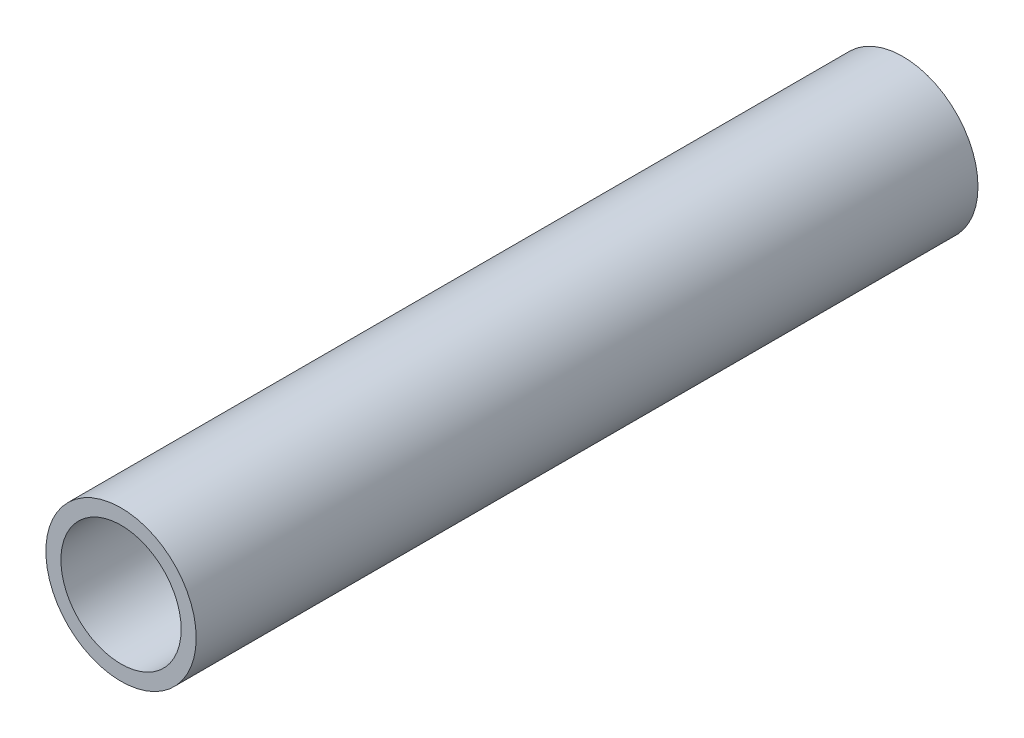
ISO-10303-21;
HEADER;
FILE_DESCRIPTION(('STEP AP214'),'2;1');
FILE_NAME('part.step','',(''),(''),'','','');
FILE_SCHEMA(('AUTOMOTIVE_DESIGN { 1 0 10303 214 1 1 1 1 }'));
ENDSEC;
DATA;
#1=APPLICATION_CONTEXT('core data for automotive mechanical design processes');
#2=APPLICATION_PROTOCOL_DEFINITION('international standard','automotive_design',2000,#1);
#3=PRODUCT_CONTEXT('',#1,'mechanical');
#4=PRODUCT('Part','Part','',(#3));
#5=PRODUCT_RELATED_PRODUCT_CATEGORY('part','',(#4));
#6=PRODUCT_DEFINITION_FORMATION('','',#4);
#7=PRODUCT_DEFINITION_CONTEXT('part definition',#1,'design');
#8=PRODUCT_DEFINITION('design','',#6,#7);
#9=PRODUCT_DEFINITION_SHAPE('','',#8);
#10=(LENGTH_UNIT() NAMED_UNIT(*) SI_UNIT(.MILLI.,.METRE.));
#11=(NAMED_UNIT(*) PLANE_ANGLE_UNIT() SI_UNIT($,.RADIAN.));
#12=(NAMED_UNIT(*) SI_UNIT($,.STERADIAN.) SOLID_ANGLE_UNIT());
#13=UNCERTAINTY_MEASURE_WITH_UNIT(LENGTH_MEASURE(1.E-05),#10,'distance_accuracy_value','');
#14=(GEOMETRIC_REPRESENTATION_CONTEXT(3) GLOBAL_UNCERTAINTY_ASSIGNED_CONTEXT((#13)) GLOBAL_UNIT_ASSIGNED_CONTEXT((#10,
#11,#12)) REPRESENTATION_CONTEXT('',''));
#15=CARTESIAN_POINT('',(0.,0.,0.));
#16=DIRECTION('',(0.,0.,1.));
#17=DIRECTION('',(1.,0.,0.));
#18=AXIS2_PLACEMENT_3D('',#15,#16,#17);
#19=CARTESIAN_POINT('',(0.,0.,130.));
#20=DIRECTION('',(0.,0.,1.));
#21=DIRECTION('',(1.,0.,0.));
#22=AXIS2_PLACEMENT_3D('',#19,#20,#21);
#23=PLANE('',#22);
#24=CARTESIAN_POINT('',(0.,0.,130.));
#25=DIRECTION('',(0.,0.,1.));
#26=DIRECTION('',(1.,0.,0.));
#27=AXIS2_PLACEMENT_3D('',#24,#25,#26);
#28=CIRCLE('',#27,12.5);
#29=CARTESIAN_POINT('',(12.5,0.,130.));
#30=VERTEX_POINT('',#29);
#31=EDGE_CURVE('E10',#30,#30,#28,.T.);
#32=ORIENTED_EDGE('',*,*,#31,.T.);
#33=EDGE_LOOP('',(#32));
#34=FACE_BOUND('',#33,.T.);
#35=CARTESIAN_POINT('',(0.,0.,130.));
#36=DIRECTION('',(0.,0.,1.));
#37=DIRECTION('',(1.,0.,0.));
#38=AXIS2_PLACEMENT_3D('',#35,#36,#37);
#39=CIRCLE('',#38,10.);
#40=CARTESIAN_POINT('',(10.,0.,130.));
#41=VERTEX_POINT('',#40);
#42=EDGE_CURVE('E46',#41,#41,#39,.T.);
#43=ORIENTED_EDGE('',*,*,#42,.F.);
#44=EDGE_LOOP('',(#43));
#45=FACE_BOUND('',#44,.T.);
#46=ADVANCED_FACE('F35',(#34,#45),#23,.T.);
#47=CARTESIAN_POINT('',(0.,0.,0.));
#48=DIRECTION('',(0.,0.,1.));
#49=DIRECTION('',(1.,0.,0.));
#50=AXIS2_PLACEMENT_3D('',#47,#48,#49);
#51=PLANE('',#50);
#52=CARTESIAN_POINT('',(0.,0.,0.));
#53=DIRECTION('',(0.,0.,1.));
#54=DIRECTION('',(1.,0.,0.));
#55=AXIS2_PLACEMENT_3D('',#52,#53,#54);
#56=CIRCLE('',#55,12.5);
#57=CARTESIAN_POINT('',(12.5,0.,0.));
#58=VERTEX_POINT('',#57);
#59=EDGE_CURVE('E39',#58,#58,#56,.T.);
#60=ORIENTED_EDGE('',*,*,#59,.F.);
#61=EDGE_LOOP('',(#60));
#62=FACE_BOUND('',#61,.T.);
#63=CARTESIAN_POINT('',(0.,0.,0.));
#64=DIRECTION('',(0.,0.,1.));
#65=DIRECTION('',(1.,0.,0.));
#66=AXIS2_PLACEMENT_3D('',#63,#64,#65);
#67=CIRCLE('',#66,10.);
#68=CARTESIAN_POINT('',(10.,0.,0.));
#69=VERTEX_POINT('',#68);
#70=EDGE_CURVE('E48',#69,#69,#67,.T.);
#71=ORIENTED_EDGE('',*,*,#70,.T.);
#72=EDGE_LOOP('',(#71));
#73=FACE_BOUND('',#72,.T.);
#74=ADVANCED_FACE('F58',(#62,#73),#51,.F.);
#75=CARTESIAN_POINT('',(0.,0.,130.));
#76=DIRECTION('',(0.,0.,-1.));
#77=DIRECTION('',(-1.,0.,0.));
#78=AXIS2_PLACEMENT_3D('',#75,#76,#77);
#79=CYLINDRICAL_SURFACE('',#78,12.5);
#80=ORIENTED_EDGE('',*,*,#31,.F.);
#81=EDGE_LOOP('',(#80));
#82=FACE_BOUND('',#81,.T.);
#83=ORIENTED_EDGE('',*,*,#59,.T.);
#84=EDGE_LOOP('',(#83));
#85=FACE_BOUND('',#84,.T.);
#86=ADVANCED_FACE('F37',(#82,#85),#79,.T.);
#87=CARTESIAN_POINT('',(0.,0.,130.));
#88=DIRECTION('',(0.,0.,-1.));
#89=DIRECTION('',(-1.,0.,0.));
#90=AXIS2_PLACEMENT_3D('',#87,#88,#89);
#91=CYLINDRICAL_SURFACE('',#90,10.);
#92=ORIENTED_EDGE('',*,*,#42,.T.);
#93=EDGE_LOOP('',(#92));
#94=FACE_BOUND('',#93,.T.);
#95=ORIENTED_EDGE('',*,*,#70,.F.);
#96=EDGE_LOOP('',(#95));
#97=FACE_BOUND('',#96,.T.);
#98=ADVANCED_FACE('F54',(#94,#97),#91,.F.);
#99=CLOSED_SHELL('',(#46,#74,#86,#98));
#100=MANIFOLD_SOLID_BREP('B2',#99);
#101=ADVANCED_BREP_SHAPE_REPRESENTATION('',(#18,#100),#14);
#102=SHAPE_DEFINITION_REPRESENTATION(#9,#101);
ENDSEC;
END-ISO-10303-21;
